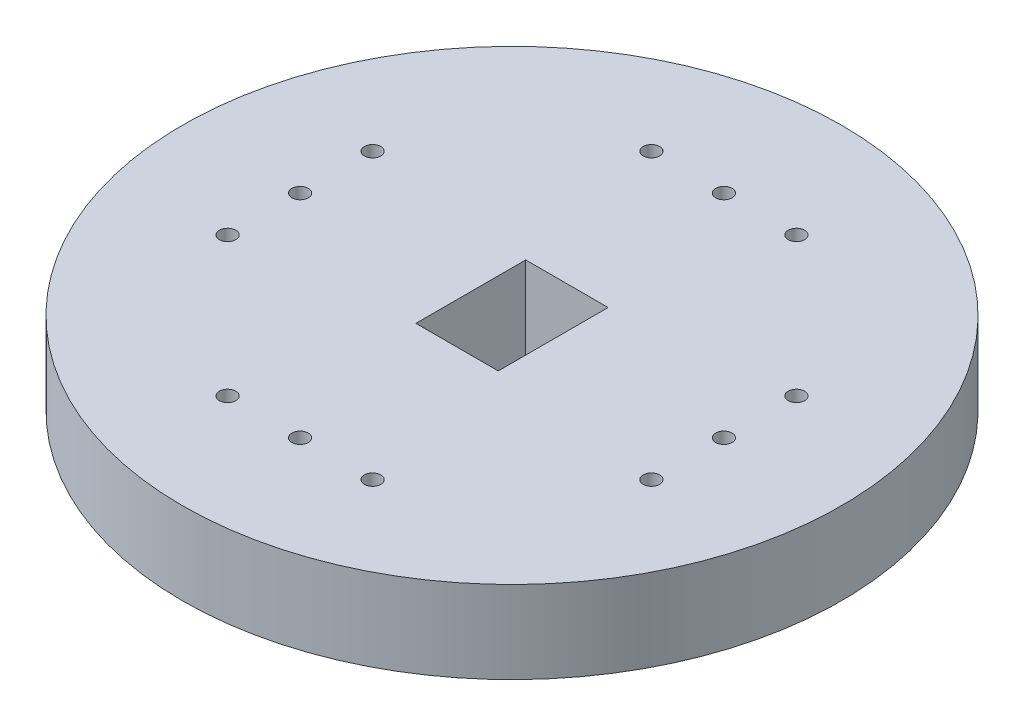
ISO-10303-21;
HEADER;
FILE_DESCRIPTION(('STEP AP214'),'2;1');
FILE_NAME('part.step','',(''),(''),'','','');
FILE_SCHEMA(('AUTOMOTIVE_DESIGN { 1 0 10303 214 1 1 1 1 }'));
ENDSEC;
DATA;
#1=APPLICATION_CONTEXT('core data for automotive mechanical design processes');
#2=APPLICATION_PROTOCOL_DEFINITION('international standard','automotive_design',2000,#1);
#3=PRODUCT_CONTEXT('',#1,'mechanical');
#4=PRODUCT('Part','Part','',(#3));
#5=PRODUCT_RELATED_PRODUCT_CATEGORY('part','',(#4));
#6=PRODUCT_DEFINITION_FORMATION('','',#4);
#7=PRODUCT_DEFINITION_CONTEXT('part definition',#1,'design');
#8=PRODUCT_DEFINITION('design','',#6,#7);
#9=PRODUCT_DEFINITION_SHAPE('','',#8);
#10=(LENGTH_UNIT() NAMED_UNIT(*) SI_UNIT(.MILLI.,.METRE.));
#11=(NAMED_UNIT(*) PLANE_ANGLE_UNIT() SI_UNIT($,.RADIAN.));
#12=(NAMED_UNIT(*) SI_UNIT($,.STERADIAN.) SOLID_ANGLE_UNIT());
#13=UNCERTAINTY_MEASURE_WITH_UNIT(LENGTH_MEASURE(1.E-05),#10,'distance_accuracy_value','');
#14=(GEOMETRIC_REPRESENTATION_CONTEXT(3) GLOBAL_UNCERTAINTY_ASSIGNED_CONTEXT((#13)) GLOBAL_UNIT_ASSIGNED_CONTEXT((#10,
#11,#12)) REPRESENTATION_CONTEXT('',''));
#15=CARTESIAN_POINT('',(0.,0.,0.));
#16=DIRECTION('',(0.,0.,1.));
#17=DIRECTION('',(1.,0.,0.));
#18=AXIS2_PLACEMENT_3D('',#15,#16,#17);
#19=CARTESIAN_POINT('',(0.,3.175,0.));
#20=DIRECTION('',(0.,-1.,0.));
#21=DIRECTION('',(0.,0.,-1.));
#22=AXIS2_PLACEMENT_3D('',#19,#20,#21);
#23=CYLINDRICAL_SURFACE('',#22,12.7);
#24=CARTESIAN_POINT('',(0.,3.175,0.));
#25=DIRECTION('',(0.,1.,0.));
#26=DIRECTION('',(0.,0.,1.));
#27=AXIS2_PLACEMENT_3D('',#24,#25,#26);
#28=CIRCLE('',#27,12.7);
#29=CARTESIAN_POINT('',(0.,3.175,12.7));
#30=VERTEX_POINT('',#29);
#31=EDGE_CURVE('E11',#30,#30,#28,.T.);
#32=ORIENTED_EDGE('',*,*,#31,.F.);
#33=EDGE_LOOP('',(#32));
#34=FACE_BOUND('',#33,.T.);
#35=CARTESIAN_POINT('',(0.,0.,0.));
#36=DIRECTION('',(0.,1.,0.));
#37=DIRECTION('',(0.,0.,1.));
#38=AXIS2_PLACEMENT_3D('',#35,#36,#37);
#39=CIRCLE('',#38,12.7);
#40=CARTESIAN_POINT('',(0.,0.,12.7));
#41=VERTEX_POINT('',#40);
#42=EDGE_CURVE('E38',#41,#41,#39,.T.);
#43=ORIENTED_EDGE('',*,*,#42,.T.);
#44=EDGE_LOOP('',(#43));
#45=FACE_BOUND('',#44,.T.);
#46=ADVANCED_FACE('F35',(#34,#45),#23,.T.);
#47=CARTESIAN_POINT('',(0.,3.175,0.));
#48=DIRECTION('',(0.,1.,0.));
#49=DIRECTION('',(0.,0.,1.));
#50=AXIS2_PLACEMENT_3D('',#47,#48,#49);
#51=PLANE('',#50);
#52=CARTESIAN_POINT('',(-8.16610000000003,3.175,-2.794));
#53=DIRECTION('',(0.,-1.,0.));
#54=DIRECTION('',(0.,0.,1.));
#55=AXIS2_PLACEMENT_3D('',#52,#53,#54);
#56=CIRCLE('',#55,0.3175);
#57=CARTESIAN_POINT('',(-8.16610000000003,3.175,-2.4765));
#58=VERTEX_POINT('',#57);
#59=EDGE_CURVE('E224',#58,#58,#56,.T.);
#60=ORIENTED_EDGE('',*,*,#59,.T.);
#61=EDGE_LOOP('',(#60));
#62=FACE_BOUND('',#61,.T.);
#63=CARTESIAN_POINT('',(-8.16609999999999,3.175,2.794));
#64=DIRECTION('',(0.,-1.,0.));
#65=DIRECTION('',(0.,0.,1.));
#66=AXIS2_PLACEMENT_3D('',#63,#64,#65);
#67=CIRCLE('',#66,0.3175);
#68=CARTESIAN_POINT('',(-8.16609999999999,3.175,3.1115));
#69=VERTEX_POINT('',#68);
#70=EDGE_CURVE('E272',#69,#69,#67,.T.);
#71=ORIENTED_EDGE('',*,*,#70,.T.);
#72=EDGE_LOOP('',(#71));
#73=FACE_BOUND('',#72,.T.);
#74=CARTESIAN_POINT('',(-8.1661,3.175,0.));
#75=DIRECTION('',(0.,-1.,0.));
#76=DIRECTION('',(0.,0.,1.));
#77=AXIS2_PLACEMENT_3D('',#74,#75,#76);
#78=CIRCLE('',#77,0.3175);
#79=CARTESIAN_POINT('',(-8.1661,3.175,0.317500000000003));
#80=VERTEX_POINT('',#79);
#81=EDGE_CURVE('E260',#80,#80,#78,.T.);
#82=ORIENTED_EDGE('',*,*,#81,.T.);
#83=EDGE_LOOP('',(#82));
#84=FACE_BOUND('',#83,.T.);
#85=CARTESIAN_POINT('',(2.794,3.175,8.1661));
#86=DIRECTION('',(0.,-1.,0.));
#87=DIRECTION('',(0.,0.,-1.));
#88=AXIS2_PLACEMENT_3D('',#85,#86,#87);
#89=CIRCLE('',#88,0.3175);
#90=CARTESIAN_POINT('',(2.794,3.175,7.8486));
#91=VERTEX_POINT('',#90);
#92=EDGE_CURVE('E237',#91,#91,#89,.T.);
#93=ORIENTED_EDGE('',*,*,#92,.T.);
#94=EDGE_LOOP('',(#93));
#95=FACE_BOUND('',#94,.T.);
#96=CARTESIAN_POINT('',(-2.794,3.175,8.16609999999998));
#97=DIRECTION('',(0.,-1.,0.));
#98=DIRECTION('',(0.,0.,-1.));
#99=AXIS2_PLACEMENT_3D('',#96,#97,#98);
#100=CIRCLE('',#99,0.3175);
#101=CARTESIAN_POINT('',(-2.794,3.175,7.84859999999998));
#102=VERTEX_POINT('',#101);
#103=EDGE_CURVE('E243',#102,#102,#100,.T.);
#104=ORIENTED_EDGE('',*,*,#103,.T.);
#105=EDGE_LOOP('',(#104));
#106=FACE_BOUND('',#105,.T.);
#107=CARTESIAN_POINT('',(2.794,3.175,-8.1661));
#108=DIRECTION('',(0.,-1.,0.));
#109=DIRECTION('',(0.,0.,1.));
#110=AXIS2_PLACEMENT_3D('',#107,#108,#109);
#111=CIRCLE('',#110,0.3175);
#112=CARTESIAN_POINT('',(2.794,3.175,-7.8486));
#113=VERTEX_POINT('',#112);
#114=EDGE_CURVE('E249',#113,#113,#111,.T.);
#115=ORIENTED_EDGE('',*,*,#114,.T.);
#116=EDGE_LOOP('',(#115));
#117=FACE_BOUND('',#116,.T.);
#118=CARTESIAN_POINT('',(0.,3.175,-8.1661));
#119=DIRECTION('',(0.,-1.,0.));
#120=DIRECTION('',(0.,0.,1.));
#121=AXIS2_PLACEMENT_3D('',#118,#119,#120);
#122=CIRCLE('',#121,0.3175);
#123=CARTESIAN_POINT('',(0.,3.175,-7.8486));
#124=VERTEX_POINT('',#123);
#125=EDGE_CURVE('E255',#124,#124,#122,.T.);
#126=ORIENTED_EDGE('',*,*,#125,.T.);
#127=EDGE_LOOP('',(#126));
#128=FACE_BOUND('',#127,.T.);
#129=CARTESIAN_POINT('',(8.16610000000003,3.175,-2.794));
#130=DIRECTION('',(0.,-1.,0.));
#131=DIRECTION('',(0.,0.,-1.));
#132=AXIS2_PLACEMENT_3D('',#129,#130,#131);
#133=CIRCLE('',#132,0.3175);
#134=CARTESIAN_POINT('',(8.16610000000003,3.175,-3.1115));
#135=VERTEX_POINT('',#134);
#136=EDGE_CURVE('E214',#135,#135,#133,.T.);
#137=ORIENTED_EDGE('',*,*,#136,.T.);
#138=EDGE_LOOP('',(#137));
#139=FACE_BOUND('',#138,.T.);
#140=CARTESIAN_POINT('',(8.16609999999999,3.175,2.794));
#141=DIRECTION('',(0.,-1.,0.));
#142=DIRECTION('',(0.,0.,-1.));
#143=AXIS2_PLACEMENT_3D('',#140,#141,#142);
#144=CIRCLE('',#143,0.3175);
#145=CARTESIAN_POINT('',(8.16609999999999,3.175,2.4765));
#146=VERTEX_POINT('',#145);
#147=EDGE_CURVE('E209',#146,#146,#144,.T.);
#148=ORIENTED_EDGE('',*,*,#147,.T.);
#149=EDGE_LOOP('',(#148));
#150=FACE_BOUND('',#149,.T.);
#151=CARTESIAN_POINT('',(8.1661,3.175,0.));
#152=DIRECTION('',(0.,-1.,0.));
#153=DIRECTION('',(0.,0.,-1.));
#154=AXIS2_PLACEMENT_3D('',#151,#152,#153);
#155=CIRCLE('',#154,0.3175);
#156=CARTESIAN_POINT('',(8.1661,3.175,-0.317499999999996));
#157=VERTEX_POINT('',#156);
#158=EDGE_CURVE('E232',#157,#157,#155,.T.);
#159=ORIENTED_EDGE('',*,*,#158,.T.);
#160=EDGE_LOOP('',(#159));
#161=FACE_BOUND('',#160,.T.);
#162=CARTESIAN_POINT('',(-2.794,3.175,-8.16609999999998));
#163=DIRECTION('',(0.,-1.,0.));
#164=DIRECTION('',(0.,0.,1.));
#165=AXIS2_PLACEMENT_3D('',#162,#163,#164);
#166=CIRCLE('',#165,0.3175);
#167=CARTESIAN_POINT('',(-2.794,3.175,-7.84859999999998));
#168=VERTEX_POINT('',#167);
#169=EDGE_CURVE('E225',#168,#168,#166,.T.);
#170=ORIENTED_EDGE('',*,*,#169,.T.);
#171=EDGE_LOOP('',(#170));
#172=FACE_BOUND('',#171,.T.);
#173=CARTESIAN_POINT('',(0.,3.175,8.1661));
#174=DIRECTION('',(0.,-1.,0.));
#175=DIRECTION('',(0.,0.,-1.));
#176=AXIS2_PLACEMENT_3D('',#173,#174,#175);
#177=CIRCLE('',#176,0.3175);
#178=CARTESIAN_POINT('',(0.,3.175,7.8486));
#179=VERTEX_POINT('',#178);
#180=EDGE_CURVE('E106',#179,#179,#177,.T.);
#181=ORIENTED_EDGE('',*,*,#180,.T.);
#182=EDGE_LOOP('',(#181));
#183=FACE_BOUND('',#182,.T.);
#184=DIRECTION('',(0.,0.,-1.));
#185=VECTOR('',#184,1.);
#186=CARTESIAN_POINT('',(1.5875,3.175,2.11666666666667));
#187=LINE('',#186,#185);
#188=CARTESIAN_POINT('',(1.5875,3.175,2.11666666666667));
#189=VERTEX_POINT('',#188);
#190=CARTESIAN_POINT('',(1.5875,3.175,-2.11666666666667));
#191=VERTEX_POINT('',#190);
#192=EDGE_CURVE('E49',#189,#191,#187,.T.);
#193=ORIENTED_EDGE('',*,*,#192,.F.);
#194=DIRECTION('',(1.,0.,0.));
#195=VECTOR('',#194,1.);
#196=CARTESIAN_POINT('',(-1.5875,3.175,2.11666666666667));
#197=LINE('',#196,#195);
#198=CARTESIAN_POINT('',(-1.5875,3.175,2.11666666666667));
#199=VERTEX_POINT('',#198);
#200=EDGE_CURVE('E93',#199,#189,#197,.T.);
#201=ORIENTED_EDGE('',*,*,#200,.F.);
#202=DIRECTION('',(0.,0.,1.));
#203=VECTOR('',#202,1.);
#204=CARTESIAN_POINT('',(-1.5875,3.175,2.11666666666667));
#205=LINE('',#204,#203);
#206=CARTESIAN_POINT('',(-1.5875,3.175,-2.11666666666667));
#207=VERTEX_POINT('',#206);
#208=EDGE_CURVE('E96',#207,#199,#205,.T.);
#209=ORIENTED_EDGE('',*,*,#208,.F.);
#210=DIRECTION('',(-1.,0.,0.));
#211=VECTOR('',#210,1.);
#212=CARTESIAN_POINT('',(-1.5875,3.175,-2.11666666666667));
#213=LINE('',#212,#211);
#214=EDGE_CURVE('E105',#191,#207,#213,.T.);
#215=ORIENTED_EDGE('',*,*,#214,.F.);
#216=EDGE_LOOP('',(#193,#201,#209,#215));
#217=FACE_BOUND('',#216,.T.);
#218=ORIENTED_EDGE('',*,*,#31,.T.);
#219=EDGE_LOOP('',(#218));
#220=FACE_BOUND('',#219,.T.);
#221=ADVANCED_FACE('F118',(#62,#73,#84,#95,#106,#117,#128,#139,#150,#161,#172,#183,#217,#220),
#51,.T.);
#222=CARTESIAN_POINT('',(0.,0.,0.));
#223=DIRECTION('',(0.,1.,0.));
#224=DIRECTION('',(0.,0.,1.));
#225=AXIS2_PLACEMENT_3D('',#222,#223,#224);
#226=PLANE('',#225);
#227=CARTESIAN_POINT('',(-8.16610000000003,0.,-2.794));
#228=DIRECTION('',(0.,-1.,0.));
#229=DIRECTION('',(0.,0.,1.));
#230=AXIS2_PLACEMENT_3D('',#227,#228,#229);
#231=CIRCLE('',#230,0.3175);
#232=CARTESIAN_POINT('',(-8.16610000000003,0.,-2.4765));
#233=VERTEX_POINT('',#232);
#234=EDGE_CURVE('E269',#233,#233,#231,.T.);
#235=ORIENTED_EDGE('',*,*,#234,.F.);
#236=EDGE_LOOP('',(#235));
#237=FACE_BOUND('',#236,.T.);
#238=CARTESIAN_POINT('',(-8.16609999999999,0.,2.794));
#239=DIRECTION('',(0.,-1.,0.));
#240=DIRECTION('',(0.,0.,1.));
#241=AXIS2_PLACEMENT_3D('',#238,#239,#240);
#242=CIRCLE('',#241,0.3175);
#243=CARTESIAN_POINT('',(-8.16609999999999,0.,3.1115));
#244=VERTEX_POINT('',#243);
#245=EDGE_CURVE('E263',#244,#244,#242,.T.);
#246=ORIENTED_EDGE('',*,*,#245,.F.);
#247=EDGE_LOOP('',(#246));
#248=FACE_BOUND('',#247,.T.);
#249=CARTESIAN_POINT('',(-8.1661,0.,0.));
#250=DIRECTION('',(0.,-1.,0.));
#251=DIRECTION('',(0.,0.,1.));
#252=AXIS2_PLACEMENT_3D('',#249,#250,#251);
#253=CIRCLE('',#252,0.3175);
#254=CARTESIAN_POINT('',(-8.1661,0.,0.317500000000003));
#255=VERTEX_POINT('',#254);
#256=EDGE_CURVE('E264',#255,#255,#253,.T.);
#257=ORIENTED_EDGE('',*,*,#256,.F.);
#258=EDGE_LOOP('',(#257));
#259=FACE_BOUND('',#258,.T.);
#260=CARTESIAN_POINT('',(2.794,0.,8.1661));
#261=DIRECTION('',(0.,-1.,0.));
#262=DIRECTION('',(0.,0.,-1.));
#263=AXIS2_PLACEMENT_3D('',#260,#261,#262);
#264=CIRCLE('',#263,0.3175);
#265=CARTESIAN_POINT('',(2.794,0.,7.8486));
#266=VERTEX_POINT('',#265);
#267=EDGE_CURVE('E240',#266,#266,#264,.T.);
#268=ORIENTED_EDGE('',*,*,#267,.F.);
#269=EDGE_LOOP('',(#268));
#270=FACE_BOUND('',#269,.T.);
#271=CARTESIAN_POINT('',(-2.794,0.,8.16609999999998));
#272=DIRECTION('',(0.,-1.,0.));
#273=DIRECTION('',(0.,0.,-1.));
#274=AXIS2_PLACEMENT_3D('',#271,#272,#273);
#275=CIRCLE('',#274,0.3175);
#276=CARTESIAN_POINT('',(-2.794,0.,7.84859999999998));
#277=VERTEX_POINT('',#276);
#278=EDGE_CURVE('E246',#277,#277,#275,.T.);
#279=ORIENTED_EDGE('',*,*,#278,.F.);
#280=EDGE_LOOP('',(#279));
#281=FACE_BOUND('',#280,.T.);
#282=CARTESIAN_POINT('',(2.794,0.,-8.1661));
#283=DIRECTION('',(0.,-1.,0.));
#284=DIRECTION('',(0.,0.,1.));
#285=AXIS2_PLACEMENT_3D('',#282,#283,#284);
#286=CIRCLE('',#285,0.3175);
#287=CARTESIAN_POINT('',(2.794,0.,-7.8486));
#288=VERTEX_POINT('',#287);
#289=EDGE_CURVE('E252',#288,#288,#286,.T.);
#290=ORIENTED_EDGE('',*,*,#289,.F.);
#291=EDGE_LOOP('',(#290));
#292=FACE_BOUND('',#291,.T.);
#293=CARTESIAN_POINT('',(0.,0.,-8.1661));
#294=DIRECTION('',(0.,-1.,0.));
#295=DIRECTION('',(0.,0.,1.));
#296=AXIS2_PLACEMENT_3D('',#293,#294,#295);
#297=CIRCLE('',#296,0.3175);
#298=CARTESIAN_POINT('',(0.,0.,-7.8486));
#299=VERTEX_POINT('',#298);
#300=EDGE_CURVE('E228',#299,#299,#297,.T.);
#301=ORIENTED_EDGE('',*,*,#300,.F.);
#302=EDGE_LOOP('',(#301));
#303=FACE_BOUND('',#302,.T.);
#304=CARTESIAN_POINT('',(8.16610000000003,0.,-2.794));
#305=DIRECTION('',(0.,-1.,0.));
#306=DIRECTION('',(0.,0.,-1.));
#307=AXIS2_PLACEMENT_3D('',#304,#305,#306);
#308=CIRCLE('',#307,0.3175);
#309=CARTESIAN_POINT('',(8.16610000000003,0.,-3.1115));
#310=VERTEX_POINT('',#309);
#311=EDGE_CURVE('E219',#310,#310,#308,.T.);
#312=ORIENTED_EDGE('',*,*,#311,.F.);
#313=EDGE_LOOP('',(#312));
#314=FACE_BOUND('',#313,.T.);
#315=CARTESIAN_POINT('',(8.16609999999999,0.,2.794));
#316=DIRECTION('',(0.,-1.,0.));
#317=DIRECTION('',(0.,0.,-1.));
#318=AXIS2_PLACEMENT_3D('',#315,#316,#317);
#319=CIRCLE('',#318,0.3175);
#320=CARTESIAN_POINT('',(8.16609999999999,0.,2.4765));
#321=VERTEX_POINT('',#320);
#322=EDGE_CURVE('E212',#321,#321,#319,.T.);
#323=ORIENTED_EDGE('',*,*,#322,.F.);
#324=EDGE_LOOP('',(#323));
#325=FACE_BOUND('',#324,.T.);
#326=CARTESIAN_POINT('',(8.1661,0.,0.));
#327=DIRECTION('',(0.,-1.,0.));
#328=DIRECTION('',(0.,0.,-1.));
#329=AXIS2_PLACEMENT_3D('',#326,#327,#328);
#330=CIRCLE('',#329,0.3175);
#331=CARTESIAN_POINT('',(8.1661,0.,-0.317499999999996));
#332=VERTEX_POINT('',#331);
#333=EDGE_CURVE('E216',#332,#332,#330,.T.);
#334=ORIENTED_EDGE('',*,*,#333,.F.);
#335=EDGE_LOOP('',(#334));
#336=FACE_BOUND('',#335,.T.);
#337=CARTESIAN_POINT('',(-2.794,0.,-8.16609999999998));
#338=DIRECTION('',(0.,-1.,0.));
#339=DIRECTION('',(0.,0.,1.));
#340=AXIS2_PLACEMENT_3D('',#337,#338,#339);
#341=CIRCLE('',#340,0.3175);
#342=CARTESIAN_POINT('',(-2.794,0.,-7.84859999999998));
#343=VERTEX_POINT('',#342);
#344=EDGE_CURVE('E229',#343,#343,#341,.T.);
#345=ORIENTED_EDGE('',*,*,#344,.F.);
#346=EDGE_LOOP('',(#345));
#347=FACE_BOUND('',#346,.T.);
#348=CARTESIAN_POINT('',(0.,0.,8.1661));
#349=DIRECTION('',(0.,-1.,0.));
#350=DIRECTION('',(0.,0.,-1.));
#351=AXIS2_PLACEMENT_3D('',#348,#349,#350);
#352=CIRCLE('',#351,0.3175);
#353=CARTESIAN_POINT('',(0.,0.,7.8486));
#354=VERTEX_POINT('',#353);
#355=EDGE_CURVE('E99',#354,#354,#352,.T.);
#356=ORIENTED_EDGE('',*,*,#355,.F.);
#357=EDGE_LOOP('',(#356));
#358=FACE_BOUND('',#357,.T.);
#359=DIRECTION('',(1.,0.,0.));
#360=VECTOR('',#359,1.);
#361=CARTESIAN_POINT('',(-1.5875,0.,2.11666666666667));
#362=LINE('',#361,#360);
#363=CARTESIAN_POINT('',(-1.5875,0.,2.11666666666667));
#364=VERTEX_POINT('',#363);
#365=CARTESIAN_POINT('',(1.5875,0.,2.11666666666667));
#366=VERTEX_POINT('',#365);
#367=EDGE_CURVE('E83',#364,#366,#362,.T.);
#368=ORIENTED_EDGE('',*,*,#367,.T.);
#369=DIRECTION('',(0.,0.,-1.));
#370=VECTOR('',#369,1.);
#371=CARTESIAN_POINT('',(1.5875,0.,2.11666666666667));
#372=LINE('',#371,#370);
#373=CARTESIAN_POINT('',(1.5875,0.,-2.11666666666667));
#374=VERTEX_POINT('',#373);
#375=EDGE_CURVE('E77',#366,#374,#372,.T.);
#376=ORIENTED_EDGE('',*,*,#375,.T.);
#377=DIRECTION('',(-1.,0.,0.));
#378=VECTOR('',#377,1.);
#379=CARTESIAN_POINT('',(-1.5875,0.,-2.11666666666667));
#380=LINE('',#379,#378);
#381=CARTESIAN_POINT('',(-1.5875,0.,-2.11666666666667));
#382=VERTEX_POINT('',#381);
#383=EDGE_CURVE('E86',#374,#382,#380,.T.);
#384=ORIENTED_EDGE('',*,*,#383,.T.);
#385=DIRECTION('',(0.,0.,1.));
#386=VECTOR('',#385,1.);
#387=CARTESIAN_POINT('',(-1.5875,0.,2.11666666666667));
#388=LINE('',#387,#386);
#389=EDGE_CURVE('E57',#382,#364,#388,.T.);
#390=ORIENTED_EDGE('',*,*,#389,.T.);
#391=EDGE_LOOP('',(#368,#376,#384,#390));
#392=FACE_BOUND('',#391,.T.);
#393=ORIENTED_EDGE('',*,*,#42,.F.);
#394=EDGE_LOOP('',(#393));
#395=FACE_BOUND('',#394,.T.);
#396=ADVANCED_FACE('F90',(#237,#248,#259,#270,#281,#292,#303,#314,#325,#336,#347,#358,#392,
#395),#226,.F.);
#397=CARTESIAN_POINT('',(1.5875,0.,2.11666666666667));
#398=DIRECTION('',(1.,0.,0.));
#399=DIRECTION('',(0.,0.,-1.));
#400=AXIS2_PLACEMENT_3D('',#397,#398,#399);
#401=PLANE('',#400);
#402=ORIENTED_EDGE('',*,*,#192,.T.);
#403=DIRECTION('',(0.,1.,0.));
#404=VECTOR('',#403,1.);
#405=CARTESIAN_POINT('',(1.5875,0.,-2.11666666666667));
#406=LINE('',#405,#404);
#407=EDGE_CURVE('E73',#374,#191,#406,.T.);
#408=ORIENTED_EDGE('',*,*,#407,.F.);
#409=ORIENTED_EDGE('',*,*,#375,.F.);
#410=DIRECTION('',(0.,1.,0.));
#411=VECTOR('',#410,1.);
#412=CARTESIAN_POINT('',(1.5875,0.,2.11666666666667));
#413=LINE('',#412,#411);
#414=EDGE_CURVE('E110',#366,#189,#413,.T.);
#415=ORIENTED_EDGE('',*,*,#414,.T.);
#416=EDGE_LOOP('',(#402,#408,#409,#415));
#417=FACE_BOUND('',#416,.T.);
#418=ADVANCED_FACE('F75',(#417),#401,.F.);
#419=CARTESIAN_POINT('',(-1.5875,0.,2.11666666666667));
#420=DIRECTION('',(0.,0.,1.));
#421=DIRECTION('',(1.,0.,0.));
#422=AXIS2_PLACEMENT_3D('',#419,#420,#421);
#423=PLANE('',#422);
#424=ORIENTED_EDGE('',*,*,#200,.T.);
#425=ORIENTED_EDGE('',*,*,#414,.F.);
#426=ORIENTED_EDGE('',*,*,#367,.F.);
#427=DIRECTION('',(0.,1.,0.));
#428=VECTOR('',#427,1.);
#429=CARTESIAN_POINT('',(-1.5875,0.,2.11666666666667));
#430=LINE('',#429,#428);
#431=EDGE_CURVE('E112',#364,#199,#430,.T.);
#432=ORIENTED_EDGE('',*,*,#431,.T.);
#433=EDGE_LOOP('',(#424,#425,#426,#432));
#434=FACE_BOUND('',#433,.T.);
#435=ADVANCED_FACE('F121',(#434),#423,.F.);
#436=CARTESIAN_POINT('',(-1.5875,0.,2.11666666666667));
#437=DIRECTION('',(-1.,0.,0.));
#438=DIRECTION('',(0.,0.,1.));
#439=AXIS2_PLACEMENT_3D('',#436,#437,#438);
#440=PLANE('',#439);
#441=ORIENTED_EDGE('',*,*,#208,.T.);
#442=ORIENTED_EDGE('',*,*,#431,.F.);
#443=ORIENTED_EDGE('',*,*,#389,.F.);
#444=DIRECTION('',(0.,1.,0.));
#445=VECTOR('',#444,1.);
#446=CARTESIAN_POINT('',(-1.5875,0.,-2.11666666666667));
#447=LINE('',#446,#445);
#448=EDGE_CURVE('E82',#382,#207,#447,.T.);
#449=ORIENTED_EDGE('',*,*,#448,.T.);
#450=EDGE_LOOP('',(#441,#442,#443,#449));
#451=FACE_BOUND('',#450,.T.);
#452=ADVANCED_FACE('F114',(#451),#440,.F.);
#453=CARTESIAN_POINT('',(-1.5875,0.,-2.11666666666667));
#454=DIRECTION('',(0.,0.,-1.));
#455=DIRECTION('',(-1.,0.,0.));
#456=AXIS2_PLACEMENT_3D('',#453,#454,#455);
#457=PLANE('',#456);
#458=ORIENTED_EDGE('',*,*,#214,.T.);
#459=ORIENTED_EDGE('',*,*,#448,.F.);
#460=ORIENTED_EDGE('',*,*,#383,.F.);
#461=ORIENTED_EDGE('',*,*,#407,.T.);
#462=EDGE_LOOP('',(#458,#459,#460,#461));
#463=FACE_BOUND('',#462,.T.);
#464=ADVANCED_FACE('F87',(#463),#457,.F.);
#465=CARTESIAN_POINT('',(0.,3.175,8.1661));
#466=DIRECTION('',(0.,-1.,0.));
#467=DIRECTION('',(0.,0.,-1.));
#468=AXIS2_PLACEMENT_3D('',#465,#466,#467);
#469=CYLINDRICAL_SURFACE('',#468,0.3175);
#470=ORIENTED_EDGE('',*,*,#180,.F.);
#471=EDGE_LOOP('',(#470));
#472=FACE_BOUND('',#471,.T.);
#473=ORIENTED_EDGE('',*,*,#355,.T.);
#474=EDGE_LOOP('',(#473));
#475=FACE_BOUND('',#474,.T.);
#476=ADVANCED_FACE('F152',(#472,#475),#469,.F.);
#477=CARTESIAN_POINT('',(-2.794,3.175,-8.16609999999998));
#478=DIRECTION('',(0.,-1.,0.));
#479=DIRECTION('',(0.,0.,-1.));
#480=AXIS2_PLACEMENT_3D('',#477,#478,#479);
#481=CYLINDRICAL_SURFACE('',#480,0.3175);
#482=ORIENTED_EDGE('',*,*,#169,.F.);
#483=EDGE_LOOP('',(#482));
#484=FACE_BOUND('',#483,.T.);
#485=ORIENTED_EDGE('',*,*,#344,.T.);
#486=EDGE_LOOP('',(#485));
#487=FACE_BOUND('',#486,.T.);
#488=ADVANCED_FACE('F156',(#484,#487),#481,.F.);
#489=CARTESIAN_POINT('',(8.1661,3.175,0.));
#490=DIRECTION('',(0.,-1.,0.));
#491=DIRECTION('',(0.,0.,-1.));
#492=AXIS2_PLACEMENT_3D('',#489,#490,#491);
#493=CYLINDRICAL_SURFACE('',#492,0.3175);
#494=ORIENTED_EDGE('',*,*,#158,.F.);
#495=EDGE_LOOP('',(#494));
#496=FACE_BOUND('',#495,.T.);
#497=ORIENTED_EDGE('',*,*,#333,.T.);
#498=EDGE_LOOP('',(#497));
#499=FACE_BOUND('',#498,.T.);
#500=ADVANCED_FACE('F160',(#496,#499),#493,.F.);
#501=CARTESIAN_POINT('',(8.16609999999999,3.175,2.794));
#502=DIRECTION('',(0.,-1.,0.));
#503=DIRECTION('',(0.,0.,-1.));
#504=AXIS2_PLACEMENT_3D('',#501,#502,#503);
#505=CYLINDRICAL_SURFACE('',#504,0.3175);
#506=ORIENTED_EDGE('',*,*,#147,.F.);
#507=EDGE_LOOP('',(#506));
#508=FACE_BOUND('',#507,.T.);
#509=ORIENTED_EDGE('',*,*,#322,.T.);
#510=EDGE_LOOP('',(#509));
#511=FACE_BOUND('',#510,.T.);
#512=ADVANCED_FACE('F196',(#508,#511),#505,.F.);
#513=CARTESIAN_POINT('',(8.16610000000003,3.175,-2.794));
#514=DIRECTION('',(0.,-1.,0.));
#515=DIRECTION('',(0.,0.,-1.));
#516=AXIS2_PLACEMENT_3D('',#513,#514,#515);
#517=CYLINDRICAL_SURFACE('',#516,0.3175);
#518=ORIENTED_EDGE('',*,*,#136,.F.);
#519=EDGE_LOOP('',(#518));
#520=FACE_BOUND('',#519,.T.);
#521=ORIENTED_EDGE('',*,*,#311,.T.);
#522=EDGE_LOOP('',(#521));
#523=FACE_BOUND('',#522,.T.);
#524=ADVANCED_FACE('F183',(#520,#523),#517,.F.);
#525=CARTESIAN_POINT('',(0.,3.175,-8.1661));
#526=DIRECTION('',(0.,-1.,0.));
#527=DIRECTION('',(0.,0.,-1.));
#528=AXIS2_PLACEMENT_3D('',#525,#526,#527);
#529=CYLINDRICAL_SURFACE('',#528,0.3175);
#530=ORIENTED_EDGE('',*,*,#125,.F.);
#531=EDGE_LOOP('',(#530));
#532=FACE_BOUND('',#531,.T.);
#533=ORIENTED_EDGE('',*,*,#300,.T.);
#534=EDGE_LOOP('',(#533));
#535=FACE_BOUND('',#534,.T.);
#536=ADVANCED_FACE('F179',(#532,#535),#529,.F.);
#537=CARTESIAN_POINT('',(2.794,3.175,-8.1661));
#538=DIRECTION('',(0.,-1.,0.));
#539=DIRECTION('',(0.,0.,-1.));
#540=AXIS2_PLACEMENT_3D('',#537,#538,#539);
#541=CYLINDRICAL_SURFACE('',#540,0.3175);
#542=ORIENTED_EDGE('',*,*,#114,.F.);
#543=EDGE_LOOP('',(#542));
#544=FACE_BOUND('',#543,.T.);
#545=ORIENTED_EDGE('',*,*,#289,.T.);
#546=EDGE_LOOP('',(#545));
#547=FACE_BOUND('',#546,.T.);
#548=ADVANCED_FACE('F182',(#544,#547),#541,.F.);
#549=CARTESIAN_POINT('',(-2.794,3.175,8.16609999999998));
#550=DIRECTION('',(0.,-1.,0.));
#551=DIRECTION('',(0.,0.,-1.));
#552=AXIS2_PLACEMENT_3D('',#549,#550,#551);
#553=CYLINDRICAL_SURFACE('',#552,0.3175);
#554=ORIENTED_EDGE('',*,*,#103,.F.);
#555=EDGE_LOOP('',(#554));
#556=FACE_BOUND('',#555,.T.);
#557=ORIENTED_EDGE('',*,*,#278,.T.);
#558=EDGE_LOOP('',(#557));
#559=FACE_BOUND('',#558,.T.);
#560=ADVANCED_FACE('F187',(#556,#559),#553,.F.);
#561=CARTESIAN_POINT('',(2.794,3.175,8.1661));
#562=DIRECTION('',(0.,-1.,0.));
#563=DIRECTION('',(0.,0.,-1.));
#564=AXIS2_PLACEMENT_3D('',#561,#562,#563);
#565=CYLINDRICAL_SURFACE('',#564,0.3175);
#566=ORIENTED_EDGE('',*,*,#92,.F.);
#567=EDGE_LOOP('',(#566));
#568=FACE_BOUND('',#567,.T.);
#569=ORIENTED_EDGE('',*,*,#267,.T.);
#570=EDGE_LOOP('',(#569));
#571=FACE_BOUND('',#570,.T.);
#572=ADVANCED_FACE('F177',(#568,#571),#565,.F.);
#573=CARTESIAN_POINT('',(-8.1661,3.175,0.));
#574=DIRECTION('',(0.,-1.,0.));
#575=DIRECTION('',(0.,0.,-1.));
#576=AXIS2_PLACEMENT_3D('',#573,#574,#575);
#577=CYLINDRICAL_SURFACE('',#576,0.3175);
#578=ORIENTED_EDGE('',*,*,#81,.F.);
#579=EDGE_LOOP('',(#578));
#580=FACE_BOUND('',#579,.T.);
#581=ORIENTED_EDGE('',*,*,#256,.T.);
#582=EDGE_LOOP('',(#581));
#583=FACE_BOUND('',#582,.T.);
#584=ADVANCED_FACE('F170',(#580,#583),#577,.F.);
#585=CARTESIAN_POINT('',(-8.16609999999999,3.175,2.794));
#586=DIRECTION('',(0.,-1.,0.));
#587=DIRECTION('',(0.,0.,-1.));
#588=AXIS2_PLACEMENT_3D('',#585,#586,#587);
#589=CYLINDRICAL_SURFACE('',#588,0.3175);
#590=ORIENTED_EDGE('',*,*,#70,.F.);
#591=EDGE_LOOP('',(#590));
#592=FACE_BOUND('',#591,.T.);
#593=ORIENTED_EDGE('',*,*,#245,.T.);
#594=EDGE_LOOP('',(#593));
#595=FACE_BOUND('',#594,.T.);
#596=ADVANCED_FACE('F166',(#592,#595),#589,.F.);
#597=CARTESIAN_POINT('',(-8.16610000000003,3.175,-2.794));
#598=DIRECTION('',(0.,-1.,0.));
#599=DIRECTION('',(0.,0.,-1.));
#600=AXIS2_PLACEMENT_3D('',#597,#598,#599);
#601=CYLINDRICAL_SURFACE('',#600,0.3175);
#602=ORIENTED_EDGE('',*,*,#59,.F.);
#603=EDGE_LOOP('',(#602));
#604=FACE_BOUND('',#603,.T.);
#605=ORIENTED_EDGE('',*,*,#234,.T.);
#606=EDGE_LOOP('',(#605));
#607=FACE_BOUND('',#606,.T.);
#608=ADVANCED_FACE('F169',(#604,#607),#601,.F.);
#609=CLOSED_SHELL('',(#46,#221,#396,#418,#435,#452,#464,#476,#488,#500,#512,#524,#536,#548,#560,
#572,#584,#596,#608));
#610=MANIFOLD_SOLID_BREP('B2',#609);
#611=ADVANCED_BREP_SHAPE_REPRESENTATION('',(#18,#610),#14);
#612=SHAPE_DEFINITION_REPRESENTATION(#9,#611);
ENDSEC;
END-ISO-10303-21;
